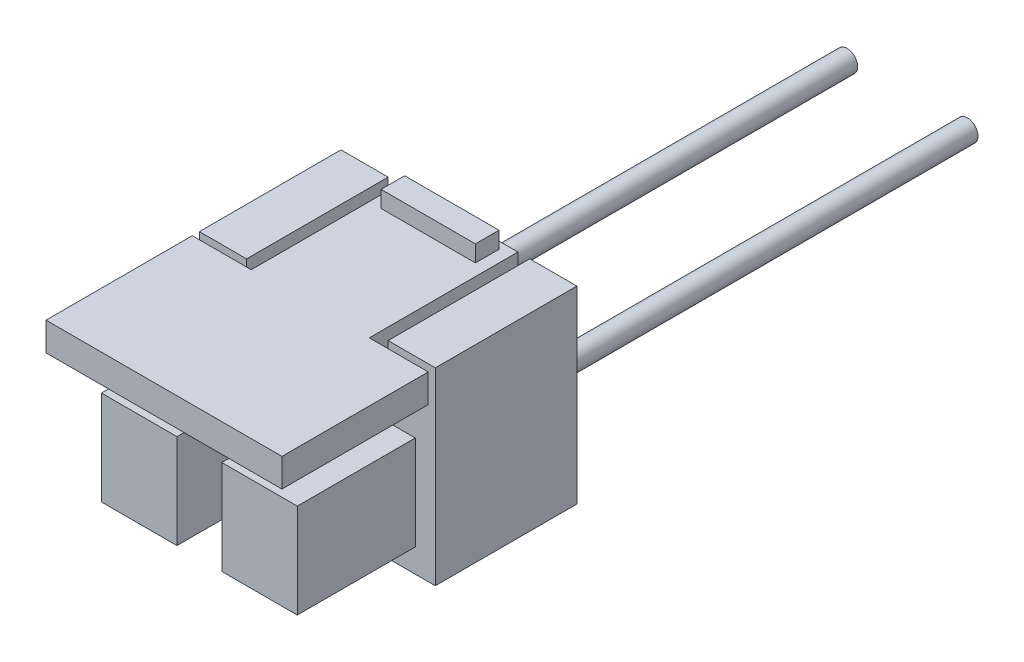
ISO-10303-21;
HEADER;
FILE_DESCRIPTION(('STEP AP214'),'2;1');
FILE_NAME('part.step','',(''),(''),'','','');
FILE_SCHEMA(('AUTOMOTIVE_DESIGN { 1 0 10303 214 1 1 1 1 }'));
ENDSEC;
DATA;
#1=APPLICATION_CONTEXT('core data for automotive mechanical design processes');
#2=APPLICATION_PROTOCOL_DEFINITION('international standard','automotive_design',2000,#1);
#3=PRODUCT_CONTEXT('',#1,'mechanical');
#4=PRODUCT('Part','Part','',(#3));
#5=PRODUCT_RELATED_PRODUCT_CATEGORY('part','',(#4));
#6=PRODUCT_DEFINITION_FORMATION('','',#4);
#7=PRODUCT_DEFINITION_CONTEXT('part definition',#1,'design');
#8=PRODUCT_DEFINITION('design','',#6,#7);
#9=PRODUCT_DEFINITION_SHAPE('','',#8);
#10=(LENGTH_UNIT() NAMED_UNIT(*) SI_UNIT(.MILLI.,.METRE.));
#11=(NAMED_UNIT(*) PLANE_ANGLE_UNIT() SI_UNIT($,.RADIAN.));
#12=(NAMED_UNIT(*) SI_UNIT($,.STERADIAN.) SOLID_ANGLE_UNIT());
#13=UNCERTAINTY_MEASURE_WITH_UNIT(LENGTH_MEASURE(1.E-05),#10,'distance_accuracy_value','');
#14=(GEOMETRIC_REPRESENTATION_CONTEXT(3) GLOBAL_UNCERTAINTY_ASSIGNED_CONTEXT((#13)) GLOBAL_UNIT_ASSIGNED_CONTEXT((#10,
#11,#12)) REPRESENTATION_CONTEXT('',''));
#15=CARTESIAN_POINT('',(0.,0.,0.));
#16=DIRECTION('',(0.,0.,1.));
#17=DIRECTION('',(1.,0.,0.));
#18=AXIS2_PLACEMENT_3D('',#15,#16,#17);
#19=CARTESIAN_POINT('',(5.,5.,-6.));
#20=DIRECTION('',(1.,0.,0.));
#21=DIRECTION('',(0.,0.,-1.));
#22=AXIS2_PLACEMENT_3D('',#19,#20,#21);
#23=PLANE('',#22);
#24=DIRECTION('',(0.,0.,1.));
#25=VECTOR('',#24,1.);
#26=CARTESIAN_POINT('',(5.,5.,-6.));
#27=LINE('',#26,#25);
#28=CARTESIAN_POINT('',(5.,5.,-6.));
#29=VERTEX_POINT('',#28);
#30=CARTESIAN_POINT('',(5.,5.,0.));
#31=VERTEX_POINT('',#30);
#32=EDGE_CURVE('E27',#29,#31,#27,.T.);
#33=ORIENTED_EDGE('',*,*,#32,.T.);
#34=DIRECTION('',(0.,1.,0.));
#35=VECTOR('',#34,1.);
#36=CARTESIAN_POINT('',(5.,5.,0.));
#37=LINE('',#36,#35);
#38=CARTESIAN_POINT('',(5.,-3.,0.));
#39=VERTEX_POINT('',#38);
#40=EDGE_CURVE('E429',#39,#31,#37,.T.);
#41=ORIENTED_EDGE('',*,*,#40,.F.);
#42=DIRECTION('',(0.,0.,1.));
#43=VECTOR('',#42,1.);
#44=CARTESIAN_POINT('',(5.,-3.,-6.));
#45=LINE('',#44,#43);
#46=CARTESIAN_POINT('',(5.,-3.,-6.));
#47=VERTEX_POINT('',#46);
#48=EDGE_CURVE('E11',#47,#39,#45,.T.);
#49=ORIENTED_EDGE('',*,*,#48,.F.);
#50=DIRECTION('',(0.,1.,0.));
#51=VECTOR('',#50,1.);
#52=CARTESIAN_POINT('',(5.,5.,-6.));
#53=LINE('',#52,#51);
#54=EDGE_CURVE('E441',#47,#29,#53,.T.);
#55=ORIENTED_EDGE('',*,*,#54,.T.);
#56=EDGE_LOOP('',(#33,#41,#49,#55));
#57=FACE_BOUND('',#56,.T.);
#58=ADVANCED_FACE('F17',(#57),#23,.T.);
#59=CARTESIAN_POINT('',(0.,5.,-6.));
#60=DIRECTION('',(0.,1.,0.));
#61=DIRECTION('',(0.,0.,1.));
#62=AXIS2_PLACEMENT_3D('',#59,#60,#61);
#63=PLANE('',#62);
#64=DIRECTION('',(0.,0.,-1.));
#65=VECTOR('',#64,1.);
#66=CARTESIAN_POINT('',(3.,5.,-6.));
#67=LINE('',#66,#65);
#68=CARTESIAN_POINT('',(3.,5.,0.));
#69=VERTEX_POINT('',#68);
#70=CARTESIAN_POINT('',(3.,5.,-6.));
#71=VERTEX_POINT('',#70);
#72=EDGE_CURVE('E326',#69,#71,#67,.T.);
#73=ORIENTED_EDGE('',*,*,#72,.F.);
#74=DIRECTION('',(-1.,0.,0.));
#75=VECTOR('',#74,1.);
#76=CARTESIAN_POINT('',(3.,5.,0.));
#77=LINE('',#76,#75);
#78=EDGE_CURVE('E333',#31,#69,#77,.T.);
#79=ORIENTED_EDGE('',*,*,#78,.F.);
#80=ORIENTED_EDGE('',*,*,#32,.F.);
#81=DIRECTION('',(-1.,0.,0.));
#82=VECTOR('',#81,1.);
#83=CARTESIAN_POINT('',(0.,5.,-6.));
#84=LINE('',#83,#82);
#85=EDGE_CURVE('E426',#29,#71,#84,.T.);
#86=ORIENTED_EDGE('',*,*,#85,.T.);
#87=EDGE_LOOP('',(#73,#79,#80,#86));
#88=FACE_BOUND('',#87,.T.);
#89=ADVANCED_FACE('F388',(#88),#63,.T.);
#90=CARTESIAN_POINT('',(5.,-3.,0.));
#91=DIRECTION('',(0.,0.,1.));
#92=DIRECTION('',(1.,0.,0.));
#93=AXIS2_PLACEMENT_3D('',#90,#91,#92);
#94=PLANE('',#93);
#95=DIRECTION('',(1.,0.,0.));
#96=VECTOR('',#95,1.);
#97=CARTESIAN_POINT('',(0.,3.8,0.));
#98=LINE('',#97,#96);
#99=CARTESIAN_POINT('',(-2.5,3.8,0.));
#100=VERTEX_POINT('',#99);
#101=CARTESIAN_POINT('',(2.5,3.8,0.));
#102=VERTEX_POINT('',#101);
#103=EDGE_CURVE('E433',#100,#102,#98,.T.);
#104=ORIENTED_EDGE('',*,*,#103,.F.);
#105=DIRECTION('',(-1.,0.,0.));
#106=VECTOR('',#105,1.);
#107=CARTESIAN_POINT('',(0.,3.8,0.));
#108=LINE('',#107,#106);
#109=CARTESIAN_POINT('',(-3.,3.8,0.));
#110=VERTEX_POINT('',#109);
#111=EDGE_CURVE('E307',#100,#110,#108,.T.);
#112=ORIENTED_EDGE('',*,*,#111,.T.);
#113=DIRECTION('',(0.,1.,0.));
#114=VECTOR('',#113,1.);
#115=CARTESIAN_POINT('',(-3.,-2.97790528113222,0.));
#116=LINE('',#115,#114);
#117=CARTESIAN_POINT('',(-3.,5.,0.));
#118=VERTEX_POINT('',#117);
#119=EDGE_CURVE('E248',#110,#118,#116,.T.);
#120=ORIENTED_EDGE('',*,*,#119,.T.);
#121=DIRECTION('',(1.,0.,0.));
#122=VECTOR('',#121,1.);
#123=CARTESIAN_POINT('',(-3.,5.,0.));
#124=LINE('',#123,#122);
#125=CARTESIAN_POINT('',(-5.,5.,0.));
#126=VERTEX_POINT('',#125);
#127=EDGE_CURVE('E222',#126,#118,#124,.T.);
#128=ORIENTED_EDGE('',*,*,#127,.F.);
#129=DIRECTION('',(0.,1.,0.));
#130=VECTOR('',#129,1.);
#131=CARTESIAN_POINT('',(-5.,5.,0.));
#132=LINE('',#131,#130);
#133=CARTESIAN_POINT('',(-5.,-3.,0.));
#134=VERTEX_POINT('',#133);
#135=EDGE_CURVE('E514',#134,#126,#132,.T.);
#136=ORIENTED_EDGE('',*,*,#135,.F.);
#137=DIRECTION('',(1.,0.,0.));
#138=VECTOR('',#137,1.);
#139=CARTESIAN_POINT('',(0.,-3.,0.));
#140=LINE('',#139,#138);
#141=EDGE_CURVE('E432',#134,#39,#140,.T.);
#142=ORIENTED_EDGE('',*,*,#141,.T.);
#143=ORIENTED_EDGE('',*,*,#40,.T.);
#144=ORIENTED_EDGE('',*,*,#78,.T.);
#145=DIRECTION('',(0.,1.,0.));
#146=VECTOR('',#145,1.);
#147=CARTESIAN_POINT('',(3.,-2.97790528113222,0.));
#148=LINE('',#147,#146);
#149=CARTESIAN_POINT('',(3.,3.8,0.));
#150=VERTEX_POINT('',#149);
#151=EDGE_CURVE('E337',#150,#69,#148,.T.);
#152=ORIENTED_EDGE('',*,*,#151,.F.);
#153=EDGE_CURVE('E21',#102,#150,#98,.T.);
#154=ORIENTED_EDGE('',*,*,#153,.F.);
#155=EDGE_LOOP('',(#104,#112,#120,#128,#136,#142,#143,#144,#152,#154));
#156=FACE_BOUND('',#155,.T.);
#157=DIRECTION('',(1.,0.,0.));
#158=VECTOR('',#157,1.);
#159=CARTESIAN_POINT('',(0.950000000000001,-2.,0.));
#160=LINE('',#159,#158);
#161=CARTESIAN_POINT('',(0.950000000000001,-2.,0.));
#162=VERTEX_POINT('',#161);
#163=CARTESIAN_POINT('',(4.15,-2.,0.));
#164=VERTEX_POINT('',#163);
#165=EDGE_CURVE('E866',#162,#164,#160,.T.);
#166=ORIENTED_EDGE('',*,*,#165,.F.);
#167=DIRECTION('',(0.,-1.,0.));
#168=VECTOR('',#167,1.);
#169=CARTESIAN_POINT('',(0.95,2.,0.));
#170=LINE('',#169,#168);
#171=CARTESIAN_POINT('',(0.95,2.,0.));
#172=VERTEX_POINT('',#171);
#173=EDGE_CURVE('E860',#172,#162,#170,.T.);
#174=ORIENTED_EDGE('',*,*,#173,.F.);
#175=DIRECTION('',(-1.,0.,0.));
#176=VECTOR('',#175,1.);
#177=CARTESIAN_POINT('',(0.95,2.,0.));
#178=LINE('',#177,#176);
#179=CARTESIAN_POINT('',(4.15,2.,0.));
#180=VERTEX_POINT('',#179);
#181=EDGE_CURVE('E871',#180,#172,#178,.T.);
#182=ORIENTED_EDGE('',*,*,#181,.F.);
#183=DIRECTION('',(0.,1.,0.));
#184=VECTOR('',#183,1.);
#185=CARTESIAN_POINT('',(4.15,2.,0.));
#186=LINE('',#185,#184);
#187=EDGE_CURVE('E868',#164,#180,#186,.T.);
#188=ORIENTED_EDGE('',*,*,#187,.F.);
#189=EDGE_LOOP('',(#166,#174,#182,#188));
#190=FACE_BOUND('',#189,.T.);
#191=DIRECTION('',(-1.,0.,0.));
#192=VECTOR('',#191,1.);
#193=CARTESIAN_POINT('',(-0.950000000000001,-2.,0.));
#194=LINE('',#193,#192);
#195=CARTESIAN_POINT('',(-0.950000000000001,-2.,0.));
#196=VERTEX_POINT('',#195);
#197=CARTESIAN_POINT('',(-4.15,-2.,0.));
#198=VERTEX_POINT('',#197);
#199=EDGE_CURVE('E279',#196,#198,#194,.T.);
#200=ORIENTED_EDGE('',*,*,#199,.T.);
#201=DIRECTION('',(0.,1.,0.));
#202=VECTOR('',#201,1.);
#203=CARTESIAN_POINT('',(-4.15,2.,0.));
#204=LINE('',#203,#202);
#205=CARTESIAN_POINT('',(-4.15,2.,0.));
#206=VERTEX_POINT('',#205);
#207=EDGE_CURVE('E282',#198,#206,#204,.T.);
#208=ORIENTED_EDGE('',*,*,#207,.T.);
#209=DIRECTION('',(1.,0.,0.));
#210=VECTOR('',#209,1.);
#211=CARTESIAN_POINT('',(-0.95,2.,0.));
#212=LINE('',#211,#210);
#213=CARTESIAN_POINT('',(-0.95,2.,0.));
#214=VERTEX_POINT('',#213);
#215=EDGE_CURVE('E285',#206,#214,#212,.T.);
#216=ORIENTED_EDGE('',*,*,#215,.T.);
#217=DIRECTION('',(0.,-1.,0.));
#218=VECTOR('',#217,1.);
#219=CARTESIAN_POINT('',(-0.95,2.,0.));
#220=LINE('',#219,#218);
#221=EDGE_CURVE('E276',#214,#196,#220,.T.);
#222=ORIENTED_EDGE('',*,*,#221,.T.);
#223=EDGE_LOOP('',(#200,#208,#216,#222));
#224=FACE_BOUND('',#223,.T.);
#225=ADVANCED_FACE('F393',(#156,#190,#224),#94,.T.);
#226=DIRECTION('',(0.,1.,0.));
#227=VECTOR('',#226,1.);
#228=CARTESIAN_POINT('',(5.,-2.97790528113222,0.300000000000002));
#229=LINE('',#228,#227);
#230=CARTESIAN_POINT('',(5.,3.8,0.300000000000002));
#231=VERTEX_POINT('',#230);
#232=CARTESIAN_POINT('',(5.,5.,0.300000000000002));
#233=VERTEX_POINT('',#232);
#234=EDGE_CURVE('E339',#231,#233,#229,.T.);
#235=ORIENTED_EDGE('',*,*,#234,.T.);
#236=CARTESIAN_POINT('',(4.99999999999999,5.,6.5));
#237=VERTEX_POINT('',#236);
#238=EDGE_CURVE('E411',#233,#237,#27,.T.);
#239=ORIENTED_EDGE('',*,*,#238,.T.);
#240=DIRECTION('',(0.,1.,0.));
#241=VECTOR('',#240,1.);
#242=CARTESIAN_POINT('',(4.99999999999999,3.8,6.5));
#243=LINE('',#242,#241);
#244=CARTESIAN_POINT('',(4.99999999999999,3.8,6.5));
#245=VERTEX_POINT('',#244);
#246=EDGE_CURVE('E478',#245,#237,#243,.T.);
#247=ORIENTED_EDGE('',*,*,#246,.F.);
#248=DIRECTION('',(0.,0.,-1.));
#249=VECTOR('',#248,1.);
#250=CARTESIAN_POINT('',(4.99999999999999,3.8,6.5));
#251=LINE('',#250,#249);
#252=EDGE_CURVE('E414',#245,#231,#251,.T.);
#253=ORIENTED_EDGE('',*,*,#252,.T.);
#254=EDGE_LOOP('',(#235,#239,#247,#253));
#255=FACE_BOUND('',#254,.T.);
#256=ADVANCED_FACE('F19',(#255),#23,.T.);
#257=CARTESIAN_POINT('',(0.,-3.,-6.));
#258=DIRECTION('',(0.,-1.,0.));
#259=DIRECTION('',(0.,0.,-1.));
#260=AXIS2_PLACEMENT_3D('',#257,#258,#259);
#261=PLANE('',#260);
#262=ORIENTED_EDGE('',*,*,#141,.F.);
#263=DIRECTION('',(0.,0.,1.));
#264=VECTOR('',#263,1.);
#265=CARTESIAN_POINT('',(-5.,-3.,-6.));
#266=LINE('',#265,#264);
#267=CARTESIAN_POINT('',(-5.,-3.,-6.));
#268=VERTEX_POINT('',#267);
#269=EDGE_CURVE('E329',#268,#134,#266,.T.);
#270=ORIENTED_EDGE('',*,*,#269,.F.);
#271=DIRECTION('',(1.,0.,0.));
#272=VECTOR('',#271,1.);
#273=CARTESIAN_POINT('',(0.,-3.,-6.));
#274=LINE('',#273,#272);
#275=EDGE_CURVE('E423',#268,#47,#274,.T.);
#276=ORIENTED_EDGE('',*,*,#275,.T.);
#277=ORIENTED_EDGE('',*,*,#48,.T.);
#278=EDGE_LOOP('',(#262,#270,#276,#277));
#279=FACE_BOUND('',#278,.T.);
#280=ADVANCED_FACE('F398',(#279),#261,.T.);
#281=DIRECTION('',(0.,0.,1.));
#282=VECTOR('',#281,1.);
#283=CARTESIAN_POINT('',(-5.,5.,-6.00000000000001));
#284=LINE('',#283,#282);
#285=CARTESIAN_POINT('',(-5.,5.,0.300000000000002));
#286=VERTEX_POINT('',#285);
#287=CARTESIAN_POINT('',(-5.00000000000001,5.,6.5));
#288=VERTEX_POINT('',#287);
#289=EDGE_CURVE('E234',#286,#288,#284,.T.);
#290=ORIENTED_EDGE('',*,*,#289,.T.);
#291=DIRECTION('',(-1.,0.,0.));
#292=VECTOR('',#291,1.);
#293=CARTESIAN_POINT('',(4.99999999999999,5.,6.5));
#294=LINE('',#293,#292);
#295=EDGE_CURVE('E421',#237,#288,#294,.T.);
#296=ORIENTED_EDGE('',*,*,#295,.F.);
#297=ORIENTED_EDGE('',*,*,#238,.F.);
#298=DIRECTION('',(1.,0.,0.));
#299=VECTOR('',#298,1.);
#300=CARTESIAN_POINT('',(5.,5.,0.300000000000002));
#301=LINE('',#300,#299);
#302=CARTESIAN_POINT('',(2.5,5.,0.300000000000002));
#303=VERTEX_POINT('',#302);
#304=EDGE_CURVE('E331',#303,#233,#301,.T.);
#305=ORIENTED_EDGE('',*,*,#304,.F.);
#306=DIRECTION('',(0.,0.,1.));
#307=VECTOR('',#306,1.);
#308=CARTESIAN_POINT('',(2.5,5.,0.300000000000002));
#309=LINE('',#308,#307);
#310=CARTESIAN_POINT('',(2.5,5.,-6.));
#311=VERTEX_POINT('',#310);
#312=EDGE_CURVE('E328',#311,#303,#309,.T.);
#313=ORIENTED_EDGE('',*,*,#312,.F.);
#314=CARTESIAN_POINT('',(-2.5,5.,-6.));
#315=VERTEX_POINT('',#314);
#316=EDGE_CURVE('E444',#311,#315,#84,.T.);
#317=ORIENTED_EDGE('',*,*,#316,.T.);
#318=DIRECTION('',(0.,0.,1.));
#319=VECTOR('',#318,1.);
#320=CARTESIAN_POINT('',(-2.5,5.,0.300000000000002));
#321=LINE('',#320,#319);
#322=CARTESIAN_POINT('',(-2.5,5.,0.300000000000002));
#323=VERTEX_POINT('',#322);
#324=EDGE_CURVE('E238',#315,#323,#321,.T.);
#325=ORIENTED_EDGE('',*,*,#324,.T.);
#326=DIRECTION('',(-1.,0.,0.));
#327=VECTOR('',#326,1.);
#328=CARTESIAN_POINT('',(-5.,5.,0.300000000000002));
#329=LINE('',#328,#327);
#330=EDGE_CURVE('E241',#323,#286,#329,.T.);
#331=ORIENTED_EDGE('',*,*,#330,.T.);
#332=EDGE_LOOP('',(#290,#296,#297,#305,#313,#317,#325,#331));
#333=FACE_BOUND('',#332,.T.);
#334=DIRECTION('',(1.,0.,0.));
#335=VECTOR('',#334,1.);
#336=CARTESIAN_POINT('',(2.,5.,-4.7));
#337=LINE('',#336,#335);
#338=CARTESIAN_POINT('',(-2.,5.,-4.7));
#339=VERTEX_POINT('',#338);
#340=CARTESIAN_POINT('',(2.,5.,-4.7));
#341=VERTEX_POINT('',#340);
#342=EDGE_CURVE('E361',#339,#341,#337,.T.);
#343=ORIENTED_EDGE('',*,*,#342,.F.);
#344=DIRECTION('',(0.,0.,-1.));
#345=VECTOR('',#344,1.);
#346=CARTESIAN_POINT('',(-2.,5.,-5.7));
#347=LINE('',#346,#345);
#348=CARTESIAN_POINT('',(-2.,5.,-5.7));
#349=VERTEX_POINT('',#348);
#350=EDGE_CURVE('E264',#339,#349,#347,.T.);
#351=ORIENTED_EDGE('',*,*,#350,.T.);
#352=DIRECTION('',(-1.,0.,0.));
#353=VECTOR('',#352,1.);
#354=CARTESIAN_POINT('',(0.,5.,-5.7));
#355=LINE('',#354,#353);
#356=CARTESIAN_POINT('',(2.,5.,-5.7));
#357=VERTEX_POINT('',#356);
#358=EDGE_CURVE('E353',#357,#349,#355,.T.);
#359=ORIENTED_EDGE('',*,*,#358,.F.);
#360=DIRECTION('',(0.,0.,-1.));
#361=VECTOR('',#360,1.);
#362=CARTESIAN_POINT('',(2.,5.,-5.7));
#363=LINE('',#362,#361);
#364=EDGE_CURVE('E43',#341,#357,#363,.T.);
#365=ORIENTED_EDGE('',*,*,#364,.F.);
#366=EDGE_LOOP('',(#343,#351,#359,#365));
#367=FACE_BOUND('',#366,.T.);
#368=ADVANCED_FACE('F395',(#333,#367),#63,.T.);
#369=CARTESIAN_POINT('',(5.,-3.,-6.));
#370=DIRECTION('',(0.,0.,1.));
#371=DIRECTION('',(1.,0.,0.));
#372=AXIS2_PLACEMENT_3D('',#369,#370,#371);
#373=PLANE('',#372);
#374=CARTESIAN_POINT('',(2.55,0.,-6.));
#375=DIRECTION('',(0.,0.,1.));
#376=DIRECTION('',(1.,0.,0.));
#377=AXIS2_PLACEMENT_3D('',#374,#375,#376);
#378=CIRCLE('',#377,0.45);
#379=CARTESIAN_POINT('',(3.,0.,-6.));
#380=VERTEX_POINT('',#379);
#381=EDGE_CURVE('E351',#380,#380,#378,.T.);
#382=ORIENTED_EDGE('',*,*,#381,.T.);
#383=EDGE_LOOP('',(#382));
#384=FACE_BOUND('',#383,.T.);
#385=DIRECTION('',(1.,0.,0.));
#386=VECTOR('',#385,1.);
#387=CARTESIAN_POINT('',(3.,3.8,-6.));
#388=LINE('',#387,#386);
#389=CARTESIAN_POINT('',(2.5,3.8,-6.));
#390=VERTEX_POINT('',#389);
#391=CARTESIAN_POINT('',(3.,3.8,-6.));
#392=VERTEX_POINT('',#391);
#393=EDGE_CURVE('E325',#390,#392,#388,.T.);
#394=ORIENTED_EDGE('',*,*,#393,.T.);
#395=DIRECTION('',(0.,1.,0.));
#396=VECTOR('',#395,1.);
#397=CARTESIAN_POINT('',(3.,-2.97790528113222,-6.));
#398=LINE('',#397,#396);
#399=EDGE_CURVE('E336',#392,#71,#398,.T.);
#400=ORIENTED_EDGE('',*,*,#399,.T.);
#401=ORIENTED_EDGE('',*,*,#85,.F.);
#402=ORIENTED_EDGE('',*,*,#54,.F.);
#403=ORIENTED_EDGE('',*,*,#275,.F.);
#404=DIRECTION('',(0.,1.,0.));
#405=VECTOR('',#404,1.);
#406=CARTESIAN_POINT('',(-5.,5.,-6.00000000000001));
#407=LINE('',#406,#405);
#408=CARTESIAN_POINT('',(-5.,5.,-6.00000000000001));
#409=VERTEX_POINT('',#408);
#410=EDGE_CURVE('E230',#268,#409,#407,.T.);
#411=ORIENTED_EDGE('',*,*,#410,.T.);
#412=DIRECTION('',(1.,0.,0.));
#413=VECTOR('',#412,1.);
#414=CARTESIAN_POINT('',(0.,5.,-6.));
#415=LINE('',#414,#413);
#416=CARTESIAN_POINT('',(-3.,5.,-6.));
#417=VERTEX_POINT('',#416);
#418=EDGE_CURVE('E225',#409,#417,#415,.T.);
#419=ORIENTED_EDGE('',*,*,#418,.T.);
#420=DIRECTION('',(0.,1.,0.));
#421=VECTOR('',#420,1.);
#422=CARTESIAN_POINT('',(-3.,-2.97790528113222,-6.));
#423=LINE('',#422,#421);
#424=CARTESIAN_POINT('',(-3.,3.8,-6.));
#425=VERTEX_POINT('',#424);
#426=EDGE_CURVE('E211',#425,#417,#423,.T.);
#427=ORIENTED_EDGE('',*,*,#426,.F.);
#428=DIRECTION('',(-1.,0.,0.));
#429=VECTOR('',#428,1.);
#430=CARTESIAN_POINT('',(-3.,3.8,-6.));
#431=LINE('',#430,#429);
#432=CARTESIAN_POINT('',(-2.5,3.8,-6.));
#433=VERTEX_POINT('',#432);
#434=EDGE_CURVE('E258',#433,#425,#431,.T.);
#435=ORIENTED_EDGE('',*,*,#434,.F.);
#436=DIRECTION('',(0.,1.,0.));
#437=VECTOR('',#436,1.);
#438=CARTESIAN_POINT('',(-2.5,-2.97790528113222,-6.));
#439=LINE('',#438,#437);
#440=EDGE_CURVE('E221',#433,#315,#439,.T.);
#441=ORIENTED_EDGE('',*,*,#440,.T.);
#442=ORIENTED_EDGE('',*,*,#316,.F.);
#443=DIRECTION('',(0.,1.,0.));
#444=VECTOR('',#443,1.);
#445=CARTESIAN_POINT('',(2.5,-2.97790528113222,-6.));
#446=LINE('',#445,#444);
#447=EDGE_CURVE('E343',#390,#311,#446,.T.);
#448=ORIENTED_EDGE('',*,*,#447,.F.);
#449=EDGE_LOOP('',(#394,#400,#401,#402,#403,#411,#419,#427,#435,#441,#442,#448));
#450=FACE_BOUND('',#449,.T.);
#451=CARTESIAN_POINT('',(-2.55,0.,-6.));
#452=DIRECTION('',(0.,0.,-1.));
#453=DIRECTION('',(-1.,0.,0.));
#454=AXIS2_PLACEMENT_3D('',#451,#452,#453);
#455=CIRCLE('',#454,0.45);
#456=CARTESIAN_POINT('',(-3.,0.,-6.));
#457=VERTEX_POINT('',#456);
#458=EDGE_CURVE('E263',#457,#457,#455,.T.);
#459=ORIENTED_EDGE('',*,*,#458,.F.);
#460=EDGE_LOOP('',(#459));
#461=FACE_BOUND('',#460,.T.);
#462=ADVANCED_FACE('F227',(#384,#450,#461),#373,.F.);
#463=CARTESIAN_POINT('',(0.,3.8,6.5));
#464=DIRECTION('',(0.,1.,0.));
#465=DIRECTION('',(0.,0.,1.));
#466=AXIS2_PLACEMENT_3D('',#463,#464,#465);
#467=PLANE('',#466);
#468=DIRECTION('',(0.,0.,-1.));
#469=VECTOR('',#468,1.);
#470=CARTESIAN_POINT('',(2.5,3.8,0.300000000000002));
#471=LINE('',#470,#469);
#472=CARTESIAN_POINT('',(2.5,3.8,0.300000000000002));
#473=VERTEX_POINT('',#472);
#474=EDGE_CURVE('E317',#473,#102,#471,.T.);
#475=ORIENTED_EDGE('',*,*,#474,.F.);
#476=DIRECTION('',(-1.,0.,0.));
#477=VECTOR('',#476,1.);
#478=CARTESIAN_POINT('',(5.,3.8,0.300000000000002));
#479=LINE('',#478,#477);
#480=EDGE_CURVE('E319',#231,#473,#479,.T.);
#481=ORIENTED_EDGE('',*,*,#480,.F.);
#482=ORIENTED_EDGE('',*,*,#252,.F.);
#483=DIRECTION('',(1.,0.,0.));
#484=VECTOR('',#483,1.);
#485=CARTESIAN_POINT('',(0.,3.8,6.5));
#486=LINE('',#485,#484);
#487=CARTESIAN_POINT('',(-5.00000000000001,3.8,6.5));
#488=VERTEX_POINT('',#487);
#489=EDGE_CURVE('E437',#488,#245,#486,.T.);
#490=ORIENTED_EDGE('',*,*,#489,.F.);
#491=DIRECTION('',(0.,0.,-1.));
#492=VECTOR('',#491,1.);
#493=CARTESIAN_POINT('',(-5.00000000000001,3.8,6.5));
#494=LINE('',#493,#492);
#495=CARTESIAN_POINT('',(-5.,3.8,0.300000000000002));
#496=VERTEX_POINT('',#495);
#497=EDGE_CURVE('E470',#488,#496,#494,.T.);
#498=ORIENTED_EDGE('',*,*,#497,.T.);
#499=DIRECTION('',(1.,0.,0.));
#500=VECTOR('',#499,1.);
#501=CARTESIAN_POINT('',(-5.,3.8,0.300000000000002));
#502=LINE('',#501,#500);
#503=CARTESIAN_POINT('',(-2.5,3.8,0.300000000000002));
#504=VERTEX_POINT('',#503);
#505=EDGE_CURVE('E462',#496,#504,#502,.T.);
#506=ORIENTED_EDGE('',*,*,#505,.T.);
#507=DIRECTION('',(0.,0.,-1.));
#508=VECTOR('',#507,1.);
#509=CARTESIAN_POINT('',(-2.5,3.8,0.300000000000002));
#510=LINE('',#509,#508);
#511=EDGE_CURVE('E458',#504,#100,#510,.T.);
#512=ORIENTED_EDGE('',*,*,#511,.T.);
#513=ORIENTED_EDGE('',*,*,#103,.T.);
#514=EDGE_LOOP('',(#475,#481,#482,#490,#498,#506,#512,#513));
#515=FACE_BOUND('',#514,.T.);
#516=ADVANCED_FACE('F466',(#515),#467,.F.);
#517=CARTESIAN_POINT('',(4.99999999999999,5.,6.5));
#518=DIRECTION('',(0.,0.,1.));
#519=DIRECTION('',(1.,0.,0.));
#520=AXIS2_PLACEMENT_3D('',#517,#518,#519);
#521=PLANE('',#520);
#522=ORIENTED_EDGE('',*,*,#246,.T.);
#523=ORIENTED_EDGE('',*,*,#295,.T.);
#524=DIRECTION('',(0.,1.,0.));
#525=VECTOR('',#524,1.);
#526=CARTESIAN_POINT('',(-5.00000000000001,3.8,6.5));
#527=LINE('',#526,#525);
#528=EDGE_CURVE('E310',#488,#288,#527,.T.);
#529=ORIENTED_EDGE('',*,*,#528,.F.);
#530=ORIENTED_EDGE('',*,*,#489,.T.);
#531=EDGE_LOOP('',(#522,#523,#529,#530));
#532=FACE_BOUND('',#531,.T.);
#533=ADVANCED_FACE('F495',(#532),#521,.T.);
#534=CARTESIAN_POINT('',(0.95,2.,5.));
#535=DIRECTION('',(1.,0.,0.));
#536=DIRECTION('',(0.,1.,0.));
#537=AXIS2_PLACEMENT_3D('',#534,#535,#536);
#538=PLANE('',#537);
#539=ORIENTED_EDGE('',*,*,#173,.T.);
#540=DIRECTION('',(0.,0.,-1.));
#541=VECTOR('',#540,1.);
#542=CARTESIAN_POINT('',(0.950000000000001,-2.,5.));
#543=LINE('',#542,#541);
#544=CARTESIAN_POINT('',(0.950000000000001,-2.,5.));
#545=VERTEX_POINT('',#544);
#546=EDGE_CURVE('E480',#545,#162,#543,.T.);
#547=ORIENTED_EDGE('',*,*,#546,.F.);
#548=DIRECTION('',(0.,-1.,0.));
#549=VECTOR('',#548,1.);
#550=CARTESIAN_POINT('',(0.95,2.,5.));
#551=LINE('',#550,#549);
#552=CARTESIAN_POINT('',(0.95,2.,5.));
#553=VERTEX_POINT('',#552);
#554=EDGE_CURVE('E873',#553,#545,#551,.T.);
#555=ORIENTED_EDGE('',*,*,#554,.F.);
#556=DIRECTION('',(0.,0.,-1.));
#557=VECTOR('',#556,1.);
#558=CARTESIAN_POINT('',(0.95,2.,5.));
#559=LINE('',#558,#557);
#560=EDGE_CURVE('E882',#553,#172,#559,.T.);
#561=ORIENTED_EDGE('',*,*,#560,.T.);
#562=EDGE_LOOP('',(#539,#547,#555,#561));
#563=FACE_BOUND('',#562,.T.);
#564=ADVANCED_FACE('F724',(#563),#538,.F.);
#565=CARTESIAN_POINT('',(0.950000000000001,-2.,5.));
#566=DIRECTION('',(0.,1.,0.));
#567=DIRECTION('',(-1.,0.,0.));
#568=AXIS2_PLACEMENT_3D('',#565,#566,#567);
#569=PLANE('',#568);
#570=ORIENTED_EDGE('',*,*,#165,.T.);
#571=DIRECTION('',(0.,0.,-1.));
#572=VECTOR('',#571,1.);
#573=CARTESIAN_POINT('',(4.15,-2.,5.));
#574=LINE('',#573,#572);
#575=CARTESIAN_POINT('',(4.15,-2.,5.));
#576=VERTEX_POINT('',#575);
#577=EDGE_CURVE('E482',#576,#164,#574,.T.);
#578=ORIENTED_EDGE('',*,*,#577,.F.);
#579=DIRECTION('',(1.,0.,0.));
#580=VECTOR('',#579,1.);
#581=CARTESIAN_POINT('',(0.950000000000001,-2.,5.));
#582=LINE('',#581,#580);
#583=EDGE_CURVE('E876',#545,#576,#582,.T.);
#584=ORIENTED_EDGE('',*,*,#583,.F.);
#585=ORIENTED_EDGE('',*,*,#546,.T.);
#586=EDGE_LOOP('',(#570,#578,#584,#585));
#587=FACE_BOUND('',#586,.T.);
#588=ADVANCED_FACE('F732',(#587),#569,.F.);
#589=CARTESIAN_POINT('',(4.15,2.,5.));
#590=DIRECTION('',(-1.,0.,0.));
#591=DIRECTION('',(0.,-1.,0.));
#592=AXIS2_PLACEMENT_3D('',#589,#590,#591);
#593=PLANE('',#592);
#594=ORIENTED_EDGE('',*,*,#187,.T.);
#595=DIRECTION('',(0.,0.,-1.));
#596=VECTOR('',#595,1.);
#597=CARTESIAN_POINT('',(4.15,2.,5.));
#598=LINE('',#597,#596);
#599=CARTESIAN_POINT('',(4.15,2.,5.));
#600=VERTEX_POINT('',#599);
#601=EDGE_CURVE('E488',#600,#180,#598,.T.);
#602=ORIENTED_EDGE('',*,*,#601,.F.);
#603=DIRECTION('',(0.,1.,0.));
#604=VECTOR('',#603,1.);
#605=CARTESIAN_POINT('',(4.15,2.,5.));
#606=LINE('',#605,#604);
#607=EDGE_CURVE('E878',#576,#600,#606,.T.);
#608=ORIENTED_EDGE('',*,*,#607,.F.);
#609=ORIENTED_EDGE('',*,*,#577,.T.);
#610=EDGE_LOOP('',(#594,#602,#608,#609));
#611=FACE_BOUND('',#610,.T.);
#612=ADVANCED_FACE('F741',(#611),#593,.F.);
#613=CARTESIAN_POINT('',(0.95,2.,5.));
#614=DIRECTION('',(0.,-1.,0.));
#615=DIRECTION('',(0.,0.,-1.));
#616=AXIS2_PLACEMENT_3D('',#613,#614,#615);
#617=PLANE('',#616);
#618=ORIENTED_EDGE('',*,*,#181,.T.);
#619=ORIENTED_EDGE('',*,*,#560,.F.);
#620=DIRECTION('',(-1.,0.,0.));
#621=VECTOR('',#620,1.);
#622=CARTESIAN_POINT('',(0.95,2.,5.));
#623=LINE('',#622,#621);
#624=EDGE_CURVE('E880',#600,#553,#623,.T.);
#625=ORIENTED_EDGE('',*,*,#624,.F.);
#626=ORIENTED_EDGE('',*,*,#601,.T.);
#627=EDGE_LOOP('',(#618,#619,#625,#626));
#628=FACE_BOUND('',#627,.T.);
#629=ADVANCED_FACE('F749',(#628),#617,.F.);
#630=CARTESIAN_POINT('',(0.95,2.,5.));
#631=DIRECTION('',(0.,0.,1.));
#632=DIRECTION('',(1.,0.,0.));
#633=AXIS2_PLACEMENT_3D('',#630,#631,#632);
#634=PLANE('',#633);
#635=ORIENTED_EDGE('',*,*,#554,.T.);
#636=ORIENTED_EDGE('',*,*,#583,.T.);
#637=ORIENTED_EDGE('',*,*,#607,.T.);
#638=ORIENTED_EDGE('',*,*,#624,.T.);
#639=EDGE_LOOP('',(#635,#636,#637,#638));
#640=FACE_BOUND('',#639,.T.);
#641=ADVANCED_FACE('F758',(#640),#634,.T.);
#642=CARTESIAN_POINT('',(2.,5.7,-5.7));
#643=DIRECTION('',(-1.,0.,0.));
#644=DIRECTION('',(0.,0.,1.));
#645=AXIS2_PLACEMENT_3D('',#642,#643,#644);
#646=PLANE('',#645);
#647=ORIENTED_EDGE('',*,*,#364,.T.);
#648=DIRECTION('',(0.,-1.,0.));
#649=VECTOR('',#648,1.);
#650=CARTESIAN_POINT('',(2.,5.7,-5.7));
#651=LINE('',#650,#649);
#652=CARTESIAN_POINT('',(2.,5.7,-5.7));
#653=VERTEX_POINT('',#652);
#654=EDGE_CURVE('E856',#653,#357,#651,.T.);
#655=ORIENTED_EDGE('',*,*,#654,.F.);
#656=DIRECTION('',(0.,0.,-1.));
#657=VECTOR('',#656,1.);
#658=CARTESIAN_POINT('',(2.,5.7,-5.7));
#659=LINE('',#658,#657);
#660=CARTESIAN_POINT('',(2.,5.7,-4.7));
#661=VERTEX_POINT('',#660);
#662=EDGE_CURVE('E356',#661,#653,#659,.T.);
#663=ORIENTED_EDGE('',*,*,#662,.F.);
#664=DIRECTION('',(0.,-1.,0.));
#665=VECTOR('',#664,1.);
#666=CARTESIAN_POINT('',(2.,5.7,-4.7));
#667=LINE('',#666,#665);
#668=EDGE_CURVE('E850',#661,#341,#667,.T.);
#669=ORIENTED_EDGE('',*,*,#668,.T.);
#670=EDGE_LOOP('',(#647,#655,#663,#669));
#671=FACE_BOUND('',#670,.T.);
#672=ADVANCED_FACE('F767',(#671),#646,.F.);
#673=CARTESIAN_POINT('',(0.,5.7,-5.7));
#674=DIRECTION('',(0.,0.,1.));
#675=DIRECTION('',(1.,0.,0.));
#676=AXIS2_PLACEMENT_3D('',#673,#674,#675);
#677=PLANE('',#676);
#678=ORIENTED_EDGE('',*,*,#358,.T.);
#679=DIRECTION('',(0.,-1.,0.));
#680=VECTOR('',#679,1.);
#681=CARTESIAN_POINT('',(-2.,5.7,-5.7));
#682=LINE('',#681,#680);
#683=CARTESIAN_POINT('',(-2.,5.7,-5.7));
#684=VERTEX_POINT('',#683);
#685=EDGE_CURVE('E273',#684,#349,#682,.T.);
#686=ORIENTED_EDGE('',*,*,#685,.F.);
#687=DIRECTION('',(-1.,0.,0.));
#688=VECTOR('',#687,1.);
#689=CARTESIAN_POINT('',(0.,5.7,-5.7));
#690=LINE('',#689,#688);
#691=EDGE_CURVE('E862',#653,#684,#690,.T.);
#692=ORIENTED_EDGE('',*,*,#691,.F.);
#693=ORIENTED_EDGE('',*,*,#654,.T.);
#694=EDGE_LOOP('',(#678,#686,#692,#693));
#695=FACE_BOUND('',#694,.T.);
#696=ADVANCED_FACE('F776',(#695),#677,.F.);
#697=CARTESIAN_POINT('',(2.,5.7,-4.7));
#698=DIRECTION('',(0.,0.,-1.));
#699=DIRECTION('',(-1.,0.,0.));
#700=AXIS2_PLACEMENT_3D('',#697,#698,#699);
#701=PLANE('',#700);
#702=ORIENTED_EDGE('',*,*,#342,.T.);
#703=ORIENTED_EDGE('',*,*,#668,.F.);
#704=DIRECTION('',(1.,0.,0.));
#705=VECTOR('',#704,1.);
#706=CARTESIAN_POINT('',(2.,5.7,-4.7));
#707=LINE('',#706,#705);
#708=CARTESIAN_POINT('',(-2.,5.7,-4.7));
#709=VERTEX_POINT('',#708);
#710=EDGE_CURVE('E857',#709,#661,#707,.T.);
#711=ORIENTED_EDGE('',*,*,#710,.F.);
#712=DIRECTION('',(0.,-1.,0.));
#713=VECTOR('',#712,1.);
#714=CARTESIAN_POINT('',(-2.,5.7,-4.7));
#715=LINE('',#714,#713);
#716=EDGE_CURVE('E270',#709,#339,#715,.T.);
#717=ORIENTED_EDGE('',*,*,#716,.T.);
#718=EDGE_LOOP('',(#702,#703,#711,#717));
#719=FACE_BOUND('',#718,.T.);
#720=ADVANCED_FACE('F384',(#719),#701,.F.);
#721=CARTESIAN_POINT('',(2.,5.7,-4.7));
#722=DIRECTION('',(0.,-1.,0.));
#723=DIRECTION('',(0.,0.,-1.));
#724=AXIS2_PLACEMENT_3D('',#721,#722,#723);
#725=PLANE('',#724);
#726=ORIENTED_EDGE('',*,*,#662,.T.);
#727=ORIENTED_EDGE('',*,*,#691,.T.);
#728=DIRECTION('',(0.,0.,-1.));
#729=VECTOR('',#728,1.);
#730=CARTESIAN_POINT('',(-2.,5.7,-5.7));
#731=LINE('',#730,#729);
#732=EDGE_CURVE('E267',#709,#684,#731,.T.);
#733=ORIENTED_EDGE('',*,*,#732,.F.);
#734=ORIENTED_EDGE('',*,*,#710,.T.);
#735=EDGE_LOOP('',(#726,#727,#733,#734));
#736=FACE_BOUND('',#735,.T.);
#737=ADVANCED_FACE('F373',(#736),#725,.F.);
#738=CARTESIAN_POINT('',(2.55,0.,-25.));
#739=DIRECTION('',(0.,0.,1.));
#740=DIRECTION('',(1.,0.,0.));
#741=AXIS2_PLACEMENT_3D('',#738,#739,#740);
#742=CYLINDRICAL_SURFACE('',#741,0.45);
#743=CARTESIAN_POINT('',(2.55,0.,-25.));
#744=DIRECTION('',(0.,0.,1.));
#745=DIRECTION('',(-1.,0.,0.));
#746=AXIS2_PLACEMENT_3D('',#743,#744,#745);
#747=CIRCLE('',#746,0.45);
#748=CARTESIAN_POINT('',(2.1,0.,-25.));
#749=VERTEX_POINT('',#748);
#750=EDGE_CURVE('E348',#749,#749,#747,.T.);
#751=ORIENTED_EDGE('',*,*,#750,.T.);
#752=EDGE_LOOP('',(#751));
#753=FACE_BOUND('',#752,.T.);
#754=ORIENTED_EDGE('',*,*,#381,.F.);
#755=EDGE_LOOP('',(#754));
#756=FACE_BOUND('',#755,.T.);
#757=ADVANCED_FACE('F370',(#753,#756),#742,.T.);
#758=CARTESIAN_POINT('',(2.55,0.,-25.));
#759=DIRECTION('',(0.,0.,-1.));
#760=DIRECTION('',(-1.,0.,0.));
#761=AXIS2_PLACEMENT_3D('',#758,#759,#760);
#762=PLANE('',#761);
#763=ORIENTED_EDGE('',*,*,#750,.F.);
#764=EDGE_LOOP('',(#763));
#765=FACE_BOUND('',#764,.T.);
#766=ADVANCED_FACE('F372',(#765),#762,.T.);
#767=CARTESIAN_POINT('',(3.,-2.97790528113222,-6.));
#768=DIRECTION('',(1.,0.,0.));
#769=DIRECTION('',(0.,0.,-1.));
#770=AXIS2_PLACEMENT_3D('',#767,#768,#769);
#771=PLANE('',#770);
#772=DIRECTION('',(0.,0.,1.));
#773=VECTOR('',#772,1.);
#774=CARTESIAN_POINT('',(3.,3.8,-6.));
#775=LINE('',#774,#773);
#776=EDGE_CURVE('E322',#392,#150,#775,.T.);
#777=ORIENTED_EDGE('',*,*,#776,.T.);
#778=ORIENTED_EDGE('',*,*,#151,.T.);
#779=ORIENTED_EDGE('',*,*,#72,.T.);
#780=ORIENTED_EDGE('',*,*,#399,.F.);
#781=EDGE_LOOP('',(#777,#778,#779,#780));
#782=FACE_BOUND('',#781,.T.);
#783=ADVANCED_FACE('F381',(#782),#771,.F.);
#784=CARTESIAN_POINT('',(5.,-2.97790528113222,0.300000000000002));
#785=DIRECTION('',(0.,0.,1.));
#786=DIRECTION('',(1.,0.,0.));
#787=AXIS2_PLACEMENT_3D('',#784,#785,#786);
#788=PLANE('',#787);
#789=ORIENTED_EDGE('',*,*,#480,.T.);
#790=DIRECTION('',(0.,1.,0.));
#791=VECTOR('',#790,1.);
#792=CARTESIAN_POINT('',(2.5,-2.97790528113222,0.300000000000002));
#793=LINE('',#792,#791);
#794=EDGE_CURVE('E35',#473,#303,#793,.T.);
#795=ORIENTED_EDGE('',*,*,#794,.T.);
#796=ORIENTED_EDGE('',*,*,#304,.T.);
#797=ORIENTED_EDGE('',*,*,#234,.F.);
#798=EDGE_LOOP('',(#789,#795,#796,#797));
#799=FACE_BOUND('',#798,.T.);
#800=ADVANCED_FACE('F497',(#799),#788,.F.);
#801=CARTESIAN_POINT('',(2.5,-2.97790528113222,0.300000000000002));
#802=DIRECTION('',(-1.,0.,0.));
#803=DIRECTION('',(0.,0.,1.));
#804=AXIS2_PLACEMENT_3D('',#801,#802,#803);
#805=PLANE('',#804);
#806=ORIENTED_EDGE('',*,*,#474,.T.);
#807=EDGE_CURVE('E320',#102,#390,#471,.T.);
#808=ORIENTED_EDGE('',*,*,#807,.T.);
#809=ORIENTED_EDGE('',*,*,#447,.T.);
#810=ORIENTED_EDGE('',*,*,#312,.T.);
#811=ORIENTED_EDGE('',*,*,#794,.F.);
#812=EDGE_LOOP('',(#806,#808,#809,#810,#811));
#813=FACE_BOUND('',#812,.T.);
#814=ADVANCED_FACE('F498',(#813),#805,.F.);
#815=CARTESIAN_POINT('',(0.,3.8,6.5));
#816=DIRECTION('',(0.,1.,0.));
#817=DIRECTION('',(0.,0.,1.));
#818=AXIS2_PLACEMENT_3D('',#815,#816,#817);
#819=PLANE('',#818);
#820=ORIENTED_EDGE('',*,*,#776,.F.);
#821=ORIENTED_EDGE('',*,*,#393,.F.);
#822=ORIENTED_EDGE('',*,*,#807,.F.);
#823=ORIENTED_EDGE('',*,*,#153,.T.);
#824=EDGE_LOOP('',(#820,#821,#822,#823));
#825=FACE_BOUND('',#824,.T.);
#826=ADVANCED_FACE('F501',(#825),#819,.T.);
#827=CARTESIAN_POINT('',(-5.,5.,-6.00000000000001));
#828=DIRECTION('',(-1.,0.,0.));
#829=DIRECTION('',(0.,0.,-1.));
#830=AXIS2_PLACEMENT_3D('',#827,#828,#829);
#831=PLANE('',#830);
#832=EDGE_CURVE('E511',#409,#126,#284,.T.);
#833=ORIENTED_EDGE('',*,*,#832,.F.);
#834=ORIENTED_EDGE('',*,*,#410,.F.);
#835=ORIENTED_EDGE('',*,*,#269,.T.);
#836=ORIENTED_EDGE('',*,*,#135,.T.);
#837=EDGE_LOOP('',(#833,#834,#835,#836));
#838=FACE_BOUND('',#837,.T.);
#839=ADVANCED_FACE('F513',(#838),#831,.T.);
#840=DIRECTION('',(0.,0.,-1.));
#841=VECTOR('',#840,1.);
#842=CARTESIAN_POINT('',(-3.,5.,-6.));
#843=LINE('',#842,#841);
#844=EDGE_CURVE('E216',#118,#417,#843,.T.);
#845=ORIENTED_EDGE('',*,*,#844,.T.);
#846=ORIENTED_EDGE('',*,*,#418,.F.);
#847=ORIENTED_EDGE('',*,*,#832,.T.);
#848=ORIENTED_EDGE('',*,*,#127,.T.);
#849=EDGE_LOOP('',(#845,#846,#847,#848));
#850=FACE_BOUND('',#849,.T.);
#851=ADVANCED_FACE('F237',(#850),#63,.T.);
#852=DIRECTION('',(0.,1.,0.));
#853=VECTOR('',#852,1.);
#854=CARTESIAN_POINT('',(-5.,-2.97790528113222,0.300000000000002));
#855=LINE('',#854,#853);
#856=EDGE_CURVE('E251',#496,#286,#855,.T.);
#857=ORIENTED_EDGE('',*,*,#856,.F.);
#858=ORIENTED_EDGE('',*,*,#497,.F.);
#859=ORIENTED_EDGE('',*,*,#528,.T.);
#860=ORIENTED_EDGE('',*,*,#289,.F.);
#861=EDGE_LOOP('',(#857,#858,#859,#860));
#862=FACE_BOUND('',#861,.T.);
#863=ADVANCED_FACE('F523',(#862),#831,.T.);
#864=CARTESIAN_POINT('',(-0.95,2.,5.));
#865=DIRECTION('',(-1.,0.,0.));
#866=DIRECTION('',(0.,1.,0.));
#867=AXIS2_PLACEMENT_3D('',#864,#865,#866);
#868=PLANE('',#867);
#869=ORIENTED_EDGE('',*,*,#221,.F.);
#870=DIRECTION('',(0.,0.,-1.));
#871=VECTOR('',#870,1.);
#872=CARTESIAN_POINT('',(-0.95,2.,5.));
#873=LINE('',#872,#871);
#874=CARTESIAN_POINT('',(-0.95,2.,5.));
#875=VERTEX_POINT('',#874);
#876=EDGE_CURVE('E299',#875,#214,#873,.T.);
#877=ORIENTED_EDGE('',*,*,#876,.F.);
#878=DIRECTION('',(0.,-1.,0.));
#879=VECTOR('',#878,1.);
#880=CARTESIAN_POINT('',(-0.95,2.,5.));
#881=LINE('',#880,#879);
#882=CARTESIAN_POINT('',(-0.950000000000001,-2.,5.));
#883=VERTEX_POINT('',#882);
#884=EDGE_CURVE('E288',#875,#883,#881,.T.);
#885=ORIENTED_EDGE('',*,*,#884,.T.);
#886=DIRECTION('',(0.,0.,-1.));
#887=VECTOR('',#886,1.);
#888=CARTESIAN_POINT('',(-0.950000000000001,-2.,5.));
#889=LINE('',#888,#887);
#890=EDGE_CURVE('E305',#883,#196,#889,.T.);
#891=ORIENTED_EDGE('',*,*,#890,.T.);
#892=EDGE_LOOP('',(#869,#877,#885,#891));
#893=FACE_BOUND('',#892,.T.);
#894=ADVANCED_FACE('F525',(#893),#868,.F.);
#895=CARTESIAN_POINT('',(-0.950000000000001,-2.,5.));
#896=DIRECTION('',(0.,1.,0.));
#897=DIRECTION('',(1.,0.,0.));
#898=AXIS2_PLACEMENT_3D('',#895,#896,#897);
#899=PLANE('',#898);
#900=ORIENTED_EDGE('',*,*,#199,.F.);
#901=ORIENTED_EDGE('',*,*,#890,.F.);
#902=DIRECTION('',(-1.,0.,0.));
#903=VECTOR('',#902,1.);
#904=CARTESIAN_POINT('',(-0.950000000000001,-2.,5.));
#905=LINE('',#904,#903);
#906=CARTESIAN_POINT('',(-4.15000000000001,-2.,5.));
#907=VERTEX_POINT('',#906);
#908=EDGE_CURVE('E291',#883,#907,#905,.T.);
#909=ORIENTED_EDGE('',*,*,#908,.T.);
#910=DIRECTION('',(0.,0.,-1.));
#911=VECTOR('',#910,1.);
#912=CARTESIAN_POINT('',(-4.15000000000001,-2.,5.));
#913=LINE('',#912,#911);
#914=EDGE_CURVE('E303',#907,#198,#913,.T.);
#915=ORIENTED_EDGE('',*,*,#914,.T.);
#916=EDGE_LOOP('',(#900,#901,#909,#915));
#917=FACE_BOUND('',#916,.T.);
#918=ADVANCED_FACE('F531',(#917),#899,.F.);
#919=CARTESIAN_POINT('',(-4.15,2.,5.));
#920=DIRECTION('',(1.,0.,0.));
#921=DIRECTION('',(0.,-1.,0.));
#922=AXIS2_PLACEMENT_3D('',#919,#920,#921);
#923=PLANE('',#922);
#924=ORIENTED_EDGE('',*,*,#207,.F.);
#925=ORIENTED_EDGE('',*,*,#914,.F.);
#926=DIRECTION('',(0.,1.,0.));
#927=VECTOR('',#926,1.);
#928=CARTESIAN_POINT('',(-4.15,2.,5.));
#929=LINE('',#928,#927);
#930=CARTESIAN_POINT('',(-4.15,2.,5.));
#931=VERTEX_POINT('',#930);
#932=EDGE_CURVE('E294',#907,#931,#929,.T.);
#933=ORIENTED_EDGE('',*,*,#932,.T.);
#934=DIRECTION('',(0.,0.,-1.));
#935=VECTOR('',#934,1.);
#936=CARTESIAN_POINT('',(-4.15,2.,5.));
#937=LINE('',#936,#935);
#938=EDGE_CURVE('E301',#931,#206,#937,.T.);
#939=ORIENTED_EDGE('',*,*,#938,.T.);
#940=EDGE_LOOP('',(#924,#925,#933,#939));
#941=FACE_BOUND('',#940,.T.);
#942=ADVANCED_FACE('F601',(#941),#923,.F.);
#943=CARTESIAN_POINT('',(-0.95,2.,5.));
#944=DIRECTION('',(0.,-1.,0.));
#945=DIRECTION('',(0.,0.,-1.));
#946=AXIS2_PLACEMENT_3D('',#943,#944,#945);
#947=PLANE('',#946);
#948=ORIENTED_EDGE('',*,*,#215,.F.);
#949=ORIENTED_EDGE('',*,*,#938,.F.);
#950=DIRECTION('',(1.,0.,0.));
#951=VECTOR('',#950,1.);
#952=CARTESIAN_POINT('',(-0.95,2.,5.));
#953=LINE('',#952,#951);
#954=EDGE_CURVE('E297',#931,#875,#953,.T.);
#955=ORIENTED_EDGE('',*,*,#954,.T.);
#956=ORIENTED_EDGE('',*,*,#876,.T.);
#957=EDGE_LOOP('',(#948,#949,#955,#956));
#958=FACE_BOUND('',#957,.T.);
#959=ADVANCED_FACE('F611',(#958),#947,.F.);
#960=CARTESIAN_POINT('',(-0.95,2.,5.));
#961=DIRECTION('',(0.,0.,1.));
#962=DIRECTION('',(-1.,0.,0.));
#963=AXIS2_PLACEMENT_3D('',#960,#961,#962);
#964=PLANE('',#963);
#965=ORIENTED_EDGE('',*,*,#884,.F.);
#966=ORIENTED_EDGE('',*,*,#954,.F.);
#967=ORIENTED_EDGE('',*,*,#932,.F.);
#968=ORIENTED_EDGE('',*,*,#908,.F.);
#969=EDGE_LOOP('',(#965,#966,#967,#968));
#970=FACE_BOUND('',#969,.T.);
#971=ADVANCED_FACE('F621',(#970),#964,.T.);
#972=CARTESIAN_POINT('',(-2.,5.7,-5.7));
#973=DIRECTION('',(1.,0.,0.));
#974=DIRECTION('',(0.,0.,1.));
#975=AXIS2_PLACEMENT_3D('',#972,#973,#974);
#976=PLANE('',#975);
#977=ORIENTED_EDGE('',*,*,#350,.F.);
#978=ORIENTED_EDGE('',*,*,#716,.F.);
#979=ORIENTED_EDGE('',*,*,#732,.T.);
#980=ORIENTED_EDGE('',*,*,#685,.T.);
#981=EDGE_LOOP('',(#977,#978,#979,#980));
#982=FACE_BOUND('',#981,.T.);
#983=ADVANCED_FACE('F631',(#982),#976,.F.);
#984=CARTESIAN_POINT('',(-2.55,0.,-25.));
#985=DIRECTION('',(0.,0.,1.));
#986=DIRECTION('',(-1.,0.,0.));
#987=AXIS2_PLACEMENT_3D('',#984,#985,#986);
#988=CYLINDRICAL_SURFACE('',#987,0.45);
#989=CARTESIAN_POINT('',(-2.55,0.,-25.));
#990=DIRECTION('',(0.,0.,-1.));
#991=DIRECTION('',(1.,0.,0.));
#992=AXIS2_PLACEMENT_3D('',#989,#990,#991);
#993=CIRCLE('',#992,0.45);
#994=CARTESIAN_POINT('',(-2.1,0.,-25.));
#995=VERTEX_POINT('',#994);
#996=EDGE_CURVE('E260',#995,#995,#993,.T.);
#997=ORIENTED_EDGE('',*,*,#996,.F.);
#998=EDGE_LOOP('',(#997));
#999=FACE_BOUND('',#998,.T.);
#1000=ORIENTED_EDGE('',*,*,#458,.T.);
#1001=EDGE_LOOP('',(#1000));
#1002=FACE_BOUND('',#1001,.T.);
#1003=ADVANCED_FACE('F641',(#999,#1002),#988,.T.);
#1004=CARTESIAN_POINT('',(-2.55,0.,-25.));
#1005=DIRECTION('',(0.,0.,-1.));
#1006=DIRECTION('',(1.,0.,0.));
#1007=AXIS2_PLACEMENT_3D('',#1004,#1005,#1006);
#1008=PLANE('',#1007);
#1009=ORIENTED_EDGE('',*,*,#996,.T.);
#1010=EDGE_LOOP('',(#1009));
#1011=FACE_BOUND('',#1010,.T.);
#1012=ADVANCED_FACE('F651',(#1011),#1008,.T.);
#1013=CARTESIAN_POINT('',(-3.,-2.97790528113222,-6.));
#1014=DIRECTION('',(-1.,0.,0.));
#1015=DIRECTION('',(0.,0.,-1.));
#1016=AXIS2_PLACEMENT_3D('',#1013,#1014,#1015);
#1017=PLANE('',#1016);
#1018=DIRECTION('',(0.,0.,1.));
#1019=VECTOR('',#1018,1.);
#1020=CARTESIAN_POINT('',(-3.,3.8,-6.));
#1021=LINE('',#1020,#1019);
#1022=EDGE_CURVE('E217',#425,#110,#1021,.T.);
#1023=ORIENTED_EDGE('',*,*,#1022,.F.);
#1024=ORIENTED_EDGE('',*,*,#426,.T.);
#1025=ORIENTED_EDGE('',*,*,#844,.F.);
#1026=ORIENTED_EDGE('',*,*,#119,.F.);
#1027=EDGE_LOOP('',(#1023,#1024,#1025,#1026));
#1028=FACE_BOUND('',#1027,.T.);
#1029=ADVANCED_FACE('F213',(#1028),#1017,.F.);
#1030=CARTESIAN_POINT('',(-5.,-2.97790528113222,0.300000000000002));
#1031=DIRECTION('',(0.,0.,1.));
#1032=DIRECTION('',(-1.,0.,0.));
#1033=AXIS2_PLACEMENT_3D('',#1030,#1031,#1032);
#1034=PLANE('',#1033);
#1035=ORIENTED_EDGE('',*,*,#505,.F.);
#1036=ORIENTED_EDGE('',*,*,#856,.T.);
#1037=ORIENTED_EDGE('',*,*,#330,.F.);
#1038=DIRECTION('',(0.,1.,0.));
#1039=VECTOR('',#1038,1.);
#1040=CARTESIAN_POINT('',(-2.5,-2.97790528113222,0.300000000000002));
#1041=LINE('',#1040,#1039);
#1042=EDGE_CURVE('E254',#504,#323,#1041,.T.);
#1043=ORIENTED_EDGE('',*,*,#1042,.F.);
#1044=EDGE_LOOP('',(#1035,#1036,#1037,#1043));
#1045=FACE_BOUND('',#1044,.T.);
#1046=ADVANCED_FACE('F461',(#1045),#1034,.F.);
#1047=CARTESIAN_POINT('',(-2.5,-2.97790528113222,0.300000000000002));
#1048=DIRECTION('',(1.,0.,0.));
#1049=DIRECTION('',(0.,0.,1.));
#1050=AXIS2_PLACEMENT_3D('',#1047,#1048,#1049);
#1051=PLANE('',#1050);
#1052=ORIENTED_EDGE('',*,*,#511,.F.);
#1053=ORIENTED_EDGE('',*,*,#1042,.T.);
#1054=ORIENTED_EDGE('',*,*,#324,.F.);
#1055=ORIENTED_EDGE('',*,*,#440,.F.);
#1056=EDGE_CURVE('E250',#100,#433,#510,.T.);
#1057=ORIENTED_EDGE('',*,*,#1056,.F.);
#1058=EDGE_LOOP('',(#1052,#1053,#1054,#1055,#1057));
#1059=FACE_BOUND('',#1058,.T.);
#1060=ADVANCED_FACE('F456',(#1059),#1051,.F.);
#1061=CARTESIAN_POINT('',(0.,3.8,6.5));
#1062=DIRECTION('',(0.,1.,0.));
#1063=DIRECTION('',(0.,0.,1.));
#1064=AXIS2_PLACEMENT_3D('',#1061,#1062,#1063);
#1065=PLANE('',#1064);
#1066=ORIENTED_EDGE('',*,*,#1022,.T.);
#1067=ORIENTED_EDGE('',*,*,#111,.F.);
#1068=ORIENTED_EDGE('',*,*,#1056,.T.);
#1069=ORIENTED_EDGE('',*,*,#434,.T.);
#1070=EDGE_LOOP('',(#1066,#1067,#1068,#1069));
#1071=FACE_BOUND('',#1070,.T.);
#1072=ADVANCED_FACE('F474',(#1071),#1065,.T.);
#1073=CLOSED_SHELL('',(#58,#89,#225,#256,#280,#368,#462,#516,#533,#564,#588,#612,#629,#641,#672,
#696,#720,#737,#757,#766,#783,#800,#814,#826,#839,#851,#863,#894,#918,#942,#959,#971,#983,#1003,
#1012,#1029,#1046,#1060,#1072));
#1074=MANIFOLD_SOLID_BREP('B1',#1073);
#1075=ADVANCED_BREP_SHAPE_REPRESENTATION('',(#18,#1074),#14);
#1076=SHAPE_DEFINITION_REPRESENTATION(#9,#1075);
ENDSEC;
END-ISO-10303-21;
